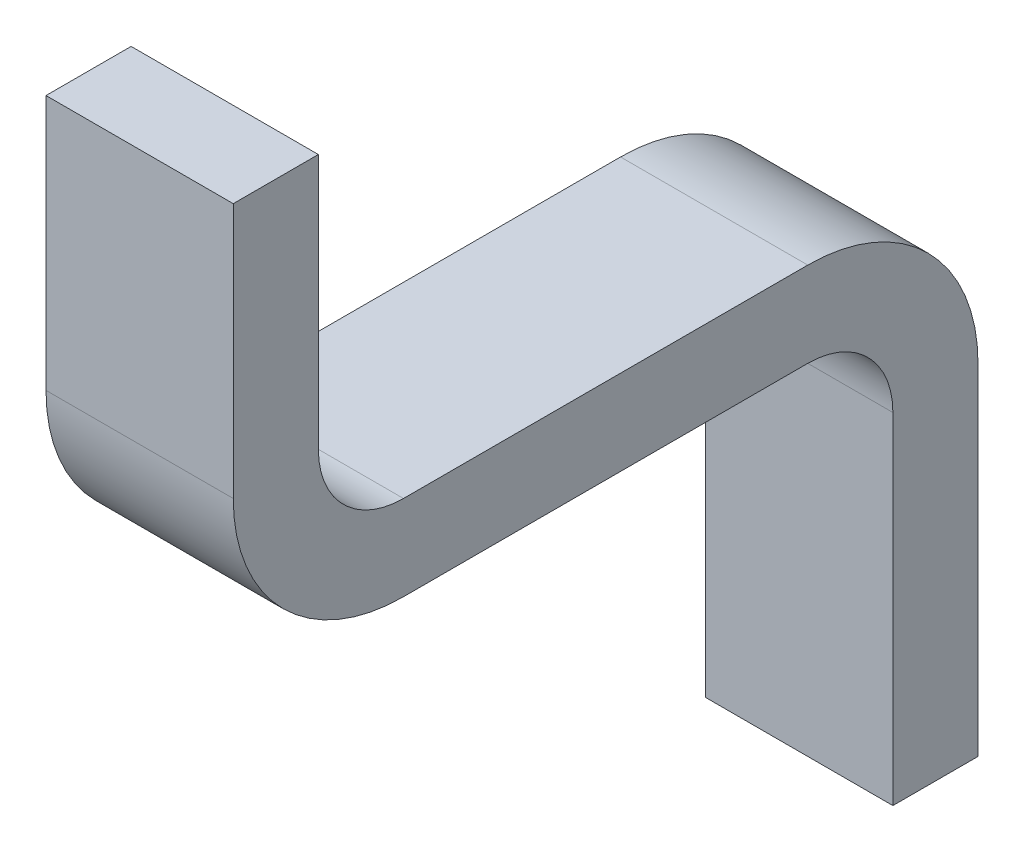
ISO-10303-21;
HEADER;
FILE_DESCRIPTION(('STEP AP214'),'2;1');
FILE_NAME('part.step','',(''),(''),'','','');
FILE_SCHEMA(('AUTOMOTIVE_DESIGN { 1 0 10303 214 1 1 1 1 }'));
ENDSEC;
DATA;
#1=APPLICATION_CONTEXT('core data for automotive mechanical design processes');
#2=APPLICATION_PROTOCOL_DEFINITION('international standard','automotive_design',2000,#1);
#3=PRODUCT_CONTEXT('',#1,'mechanical');
#4=PRODUCT('Part','Part','',(#3));
#5=PRODUCT_RELATED_PRODUCT_CATEGORY('part','',(#4));
#6=PRODUCT_DEFINITION_FORMATION('','',#4);
#7=PRODUCT_DEFINITION_CONTEXT('part definition',#1,'design');
#8=PRODUCT_DEFINITION('design','',#6,#7);
#9=PRODUCT_DEFINITION_SHAPE('','',#8);
#10=(LENGTH_UNIT() NAMED_UNIT(*) SI_UNIT(.MILLI.,.METRE.));
#11=(NAMED_UNIT(*) PLANE_ANGLE_UNIT() SI_UNIT($,.RADIAN.));
#12=(NAMED_UNIT(*) SI_UNIT($,.STERADIAN.) SOLID_ANGLE_UNIT());
#13=UNCERTAINTY_MEASURE_WITH_UNIT(LENGTH_MEASURE(1.E-05),#10,'distance_accuracy_value','');
#14=(GEOMETRIC_REPRESENTATION_CONTEXT(3) GLOBAL_UNCERTAINTY_ASSIGNED_CONTEXT((#13)) GLOBAL_UNIT_ASSIGNED_CONTEXT((#10,
#11,#12)) REPRESENTATION_CONTEXT('',''));
#15=CARTESIAN_POINT('',(0.,0.,0.));
#16=DIRECTION('',(0.,0.,1.));
#17=DIRECTION('',(1.,0.,0.));
#18=AXIS2_PLACEMENT_3D('',#15,#16,#17);
#19=CARTESIAN_POINT('',(1.14,-4.,0.675));
#20=DIRECTION('',(1.,0.,0.));
#21=DIRECTION('',(0.,1.,0.));
#22=AXIS2_PLACEMENT_3D('',#19,#20,#21);
#23=PLANE('',#22);
#24=CARTESIAN_POINT('',(1.14,-3.80000000000001,0.675));
#25=DIRECTION('',(-1.,0.,0.));
#26=DIRECTION('',(0.,-1.,0.));
#27=AXIS2_PLACEMENT_3D('',#24,#25,#26);
#28=CIRCLE('',#27,0.2);
#29=CARTESIAN_POINT('',(1.14,-3.80000000000001,0.875));
#30=VERTEX_POINT('',#29);
#31=CARTESIAN_POINT('',(1.14,-4.,0.675));
#32=VERTEX_POINT('',#31);
#33=EDGE_CURVE('E150',#30,#32,#28,.F.);
#34=ORIENTED_EDGE('',*,*,#33,.F.);
#35=DIRECTION('',(0.,1.,0.));
#36=VECTOR('',#35,1.);
#37=CARTESIAN_POINT('',(1.14,-3.5,0.875));
#38=LINE('',#37,#36);
#39=CARTESIAN_POINT('',(1.14,-3.5,0.875));
#40=VERTEX_POINT('',#39);
#41=EDGE_CURVE('E147',#30,#40,#38,.T.);
#42=ORIENTED_EDGE('',*,*,#41,.T.);
#43=DIRECTION('',(0.,0.,1.));
#44=VECTOR('',#43,1.);
#45=CARTESIAN_POINT('',(1.14,-3.5,0.775));
#46=LINE('',#45,#44);
#47=CARTESIAN_POINT('',(1.14,-3.5,0.775));
#48=VERTEX_POINT('',#47);
#49=EDGE_CURVE('E141',#48,#40,#46,.T.);
#50=ORIENTED_EDGE('',*,*,#49,.F.);
#51=DIRECTION('',(0.,1.,0.));
#52=VECTOR('',#51,1.);
#53=CARTESIAN_POINT('',(1.14,-3.5,0.775));
#54=LINE('',#53,#52);
#55=CARTESIAN_POINT('',(1.14,-3.80000000000001,0.775));
#56=VERTEX_POINT('',#55);
#57=EDGE_CURVE('E115',#48,#56,#54,.F.);
#58=ORIENTED_EDGE('',*,*,#57,.T.);
#59=CARTESIAN_POINT('',(1.14,-3.80000000000001,0.675));
#60=DIRECTION('',(-1.,0.,0.));
#61=DIRECTION('',(0.,-1.,0.));
#62=AXIS2_PLACEMENT_3D('',#59,#60,#61);
#63=CIRCLE('',#62,0.1);
#64=CARTESIAN_POINT('',(1.14,-3.9,0.675));
#65=VERTEX_POINT('',#64);
#66=EDGE_CURVE('E215',#56,#65,#63,.F.);
#67=ORIENTED_EDGE('',*,*,#66,.T.);
#68=DIRECTION('',(0.,0.,1.));
#69=VECTOR('',#68,1.);
#70=CARTESIAN_POINT('',(1.14,-3.9,0.675));
#71=LINE('',#70,#69);
#72=CARTESIAN_POINT('',(1.14,-3.9,0.2));
#73=VERTEX_POINT('',#72);
#74=EDGE_CURVE('E181',#65,#73,#71,.F.);
#75=ORIENTED_EDGE('',*,*,#74,.T.);
#76=CARTESIAN_POINT('',(1.14,-4.1,0.2));
#77=DIRECTION('',(1.,0.,0.));
#78=DIRECTION('',(0.,1.,0.));
#79=AXIS2_PLACEMENT_3D('',#76,#77,#78);
#80=CIRCLE('',#79,0.2);
#81=CARTESIAN_POINT('',(1.14,-4.1,0.));
#82=VERTEX_POINT('',#81);
#83=EDGE_CURVE('E20',#82,#73,#80,.T.);
#84=ORIENTED_EDGE('',*,*,#83,.F.);
#85=DIRECTION('',(0.,1.,0.));
#86=VECTOR('',#85,1.);
#87=CARTESIAN_POINT('',(1.14,-4.1,0.));
#88=LINE('',#87,#86);
#89=CARTESIAN_POINT('',(1.14,-4.5,0.));
#90=VERTEX_POINT('',#89);
#91=EDGE_CURVE('E91',#82,#90,#88,.F.);
#92=ORIENTED_EDGE('',*,*,#91,.T.);
#93=DIRECTION('',(0.,0.,1.));
#94=VECTOR('',#93,1.);
#95=CARTESIAN_POINT('',(1.14,-4.5,0.));
#96=LINE('',#95,#94);
#97=CARTESIAN_POINT('',(1.14,-4.5,0.1));
#98=VERTEX_POINT('',#97);
#99=EDGE_CURVE('E163',#90,#98,#96,.T.);
#100=ORIENTED_EDGE('',*,*,#99,.T.);
#101=DIRECTION('',(0.,1.,0.));
#102=VECTOR('',#101,1.);
#103=CARTESIAN_POINT('',(1.14,-4.1,0.1));
#104=LINE('',#103,#102);
#105=CARTESIAN_POINT('',(1.14,-4.1,0.1));
#106=VERTEX_POINT('',#105);
#107=EDGE_CURVE('E159',#98,#106,#104,.T.);
#108=ORIENTED_EDGE('',*,*,#107,.T.);
#109=CARTESIAN_POINT('',(1.14,-4.1,0.2));
#110=DIRECTION('',(1.,0.,0.));
#111=DIRECTION('',(0.,1.,0.));
#112=AXIS2_PLACEMENT_3D('',#109,#110,#111);
#113=CIRCLE('',#112,0.1);
#114=CARTESIAN_POINT('',(1.14,-4.,0.2));
#115=VERTEX_POINT('',#114);
#116=EDGE_CURVE('E155',#106,#115,#113,.T.);
#117=ORIENTED_EDGE('',*,*,#116,.T.);
#118=DIRECTION('',(0.,0.,1.));
#119=VECTOR('',#118,1.);
#120=CARTESIAN_POINT('',(1.14,-4.,0.675));
#121=LINE('',#120,#119);
#122=EDGE_CURVE('E154',#115,#32,#121,.T.);
#123=ORIENTED_EDGE('',*,*,#122,.T.);
#124=EDGE_LOOP('',(#34,#42,#50,#58,#67,#75,#84,#92,#100,#108,#117,#123));
#125=FACE_BOUND('',#124,.T.);
#126=ADVANCED_FACE('F17',(#125),#23,.F.);
#127=CARTESIAN_POINT('',(1.14,-4.1,0.2));
#128=DIRECTION('',(1.,0.,0.));
#129=DIRECTION('',(0.,1.,0.));
#130=AXIS2_PLACEMENT_3D('',#127,#128,#129);
#131=CYLINDRICAL_SURFACE('',#130,0.2);
#132=CARTESIAN_POINT('',(1.36,-4.1,0.2));
#133=DIRECTION('',(1.,0.,0.));
#134=DIRECTION('',(0.,1.,0.));
#135=AXIS2_PLACEMENT_3D('',#132,#133,#134);
#136=CIRCLE('',#135,0.2);
#137=CARTESIAN_POINT('',(1.36,-3.9,0.2));
#138=VERTEX_POINT('',#137);
#139=CARTESIAN_POINT('',(1.36,-4.1,0.));
#140=VERTEX_POINT('',#139);
#141=EDGE_CURVE('E183',#138,#140,#136,.F.);
#142=ORIENTED_EDGE('',*,*,#141,.T.);
#143=DIRECTION('',(1.,0.,0.));
#144=VECTOR('',#143,1.);
#145=CARTESIAN_POINT('',(1.14,-4.1,0.));
#146=LINE('',#145,#144);
#147=EDGE_CURVE('E178',#140,#82,#146,.F.);
#148=ORIENTED_EDGE('',*,*,#147,.T.);
#149=ORIENTED_EDGE('',*,*,#83,.T.);
#150=DIRECTION('',(1.,0.,0.));
#151=VECTOR('',#150,1.);
#152=CARTESIAN_POINT('',(1.14,-3.9,0.2));
#153=LINE('',#152,#151);
#154=EDGE_CURVE('E217',#73,#138,#153,.T.);
#155=ORIENTED_EDGE('',*,*,#154,.T.);
#156=EDGE_LOOP('',(#142,#148,#149,#155));
#157=FACE_BOUND('',#156,.T.);
#158=ADVANCED_FACE('F254',(#157),#131,.T.);
#159=CARTESIAN_POINT('',(1.14,-4.1,0.));
#160=DIRECTION('',(0.,0.,1.));
#161=DIRECTION('',(1.,0.,0.));
#162=AXIS2_PLACEMENT_3D('',#159,#160,#161);
#163=PLANE('',#162);
#164=ORIENTED_EDGE('',*,*,#147,.F.);
#165=DIRECTION('',(0.,-1.,0.));
#166=VECTOR('',#165,1.);
#167=CARTESIAN_POINT('',(1.36,-3.9,0.));
#168=LINE('',#167,#166);
#169=CARTESIAN_POINT('',(1.36,-4.5,0.));
#170=VERTEX_POINT('',#169);
#171=EDGE_CURVE('E170',#140,#170,#168,.T.);
#172=ORIENTED_EDGE('',*,*,#171,.T.);
#173=DIRECTION('',(-1.,0.,0.));
#174=VECTOR('',#173,1.);
#175=CARTESIAN_POINT('',(1.14,-4.5,0.));
#176=LINE('',#175,#174);
#177=EDGE_CURVE('E173',#170,#90,#176,.T.);
#178=ORIENTED_EDGE('',*,*,#177,.T.);
#179=ORIENTED_EDGE('',*,*,#91,.F.);
#180=EDGE_LOOP('',(#164,#172,#178,#179));
#181=FACE_BOUND('',#180,.T.);
#182=ADVANCED_FACE('F257',(#181),#163,.F.);
#183=CARTESIAN_POINT('',(1.14,-4.5,0.));
#184=DIRECTION('',(0.,1.,0.));
#185=DIRECTION('',(-1.,0.,0.));
#186=AXIS2_PLACEMENT_3D('',#183,#184,#185);
#187=PLANE('',#186);
#188=DIRECTION('',(-1.,0.,0.));
#189=VECTOR('',#188,1.);
#190=CARTESIAN_POINT('',(1.36,-4.5,0.1));
#191=LINE('',#190,#189);
#192=CARTESIAN_POINT('',(1.36,-4.5,0.1));
#193=VERTEX_POINT('',#192);
#194=EDGE_CURVE('E160',#193,#98,#191,.T.);
#195=ORIENTED_EDGE('',*,*,#194,.T.);
#196=ORIENTED_EDGE('',*,*,#99,.F.);
#197=ORIENTED_EDGE('',*,*,#177,.F.);
#198=DIRECTION('',(0.,0.,1.));
#199=VECTOR('',#198,1.);
#200=CARTESIAN_POINT('',(1.36,-4.5,0.675));
#201=LINE('',#200,#199);
#202=EDGE_CURVE('E166',#170,#193,#201,.T.);
#203=ORIENTED_EDGE('',*,*,#202,.T.);
#204=EDGE_LOOP('',(#195,#196,#197,#203));
#205=FACE_BOUND('',#204,.T.);
#206=ADVANCED_FACE('F259',(#205),#187,.F.);
#207=CARTESIAN_POINT('',(1.36,-4.1,0.1));
#208=DIRECTION('',(0.,0.,-1.));
#209=DIRECTION('',(-1.,0.,0.));
#210=AXIS2_PLACEMENT_3D('',#207,#208,#209);
#211=PLANE('',#210);
#212=DIRECTION('',(1.,0.,0.));
#213=VECTOR('',#212,1.);
#214=CARTESIAN_POINT('',(1.36,-4.1,0.1));
#215=LINE('',#214,#213);
#216=CARTESIAN_POINT('',(1.36,-4.1,0.1));
#217=VERTEX_POINT('',#216);
#218=EDGE_CURVE('E156',#217,#106,#215,.F.);
#219=ORIENTED_EDGE('',*,*,#218,.T.);
#220=ORIENTED_EDGE('',*,*,#107,.F.);
#221=ORIENTED_EDGE('',*,*,#194,.F.);
#222=DIRECTION('',(0.,-1.,0.));
#223=VECTOR('',#222,1.);
#224=CARTESIAN_POINT('',(1.36,-3.9,0.1));
#225=LINE('',#224,#223);
#226=EDGE_CURVE('E169',#193,#217,#225,.F.);
#227=ORIENTED_EDGE('',*,*,#226,.T.);
#228=EDGE_LOOP('',(#219,#220,#221,#227));
#229=FACE_BOUND('',#228,.T.);
#230=ADVANCED_FACE('F234',(#229),#211,.F.);
#231=CARTESIAN_POINT('',(1.36,-4.1,0.2));
#232=DIRECTION('',(1.,0.,0.));
#233=DIRECTION('',(0.,1.,0.));
#234=AXIS2_PLACEMENT_3D('',#231,#232,#233);
#235=CYLINDRICAL_SURFACE('',#234,0.1);
#236=DIRECTION('',(-1.,0.,0.));
#237=VECTOR('',#236,1.);
#238=CARTESIAN_POINT('',(1.36,-4.,0.2));
#239=LINE('',#238,#237);
#240=CARTESIAN_POINT('',(1.36,-4.,0.2));
#241=VERTEX_POINT('',#240);
#242=EDGE_CURVE('E151',#241,#115,#239,.T.);
#243=ORIENTED_EDGE('',*,*,#242,.T.);
#244=ORIENTED_EDGE('',*,*,#116,.F.);
#245=ORIENTED_EDGE('',*,*,#218,.F.);
#246=CARTESIAN_POINT('',(1.36,-4.1,0.2));
#247=DIRECTION('',(1.,0.,0.));
#248=DIRECTION('',(0.,1.,0.));
#249=AXIS2_PLACEMENT_3D('',#246,#247,#248);
#250=CIRCLE('',#249,0.1);
#251=EDGE_CURVE('E210',#217,#241,#250,.T.);
#252=ORIENTED_EDGE('',*,*,#251,.T.);
#253=EDGE_LOOP('',(#243,#244,#245,#252));
#254=FACE_BOUND('',#253,.T.);
#255=ADVANCED_FACE('F227',(#254),#235,.F.);
#256=CARTESIAN_POINT('',(1.36,-4.,0.675));
#257=DIRECTION('',(0.,1.,0.));
#258=DIRECTION('',(-1.,0.,0.));
#259=AXIS2_PLACEMENT_3D('',#256,#257,#258);
#260=PLANE('',#259);
#261=DIRECTION('',(-1.,0.,0.));
#262=VECTOR('',#261,1.);
#263=CARTESIAN_POINT('',(1.36,-4.,0.675));
#264=LINE('',#263,#262);
#265=CARTESIAN_POINT('',(1.36,-4.,0.675));
#266=VERTEX_POINT('',#265);
#267=EDGE_CURVE('E148',#32,#266,#264,.F.);
#268=ORIENTED_EDGE('',*,*,#267,.F.);
#269=ORIENTED_EDGE('',*,*,#122,.F.);
#270=ORIENTED_EDGE('',*,*,#242,.F.);
#271=DIRECTION('',(0.,0.,1.));
#272=VECTOR('',#271,1.);
#273=CARTESIAN_POINT('',(1.36,-4.,0.675));
#274=LINE('',#273,#272);
#275=EDGE_CURVE('E209',#241,#266,#274,.T.);
#276=ORIENTED_EDGE('',*,*,#275,.T.);
#277=EDGE_LOOP('',(#268,#269,#270,#276));
#278=FACE_BOUND('',#277,.T.);
#279=ADVANCED_FACE('F224',(#278),#260,.F.);
#280=CARTESIAN_POINT('',(1.36,-3.8,0.675));
#281=DIRECTION('',(-1.,0.,0.));
#282=DIRECTION('',(0.,-1.,0.));
#283=AXIS2_PLACEMENT_3D('',#280,#281,#282);
#284=CYLINDRICAL_SURFACE('',#283,0.2);
#285=ORIENTED_EDGE('',*,*,#33,.T.);
#286=ORIENTED_EDGE('',*,*,#267,.T.);
#287=CARTESIAN_POINT('',(1.36,-3.8,0.675));
#288=DIRECTION('',(-1.,0.,0.));
#289=DIRECTION('',(0.,-1.,0.));
#290=AXIS2_PLACEMENT_3D('',#287,#288,#289);
#291=CIRCLE('',#290,0.2);
#292=CARTESIAN_POINT('',(1.36,-3.8,0.875));
#293=VERTEX_POINT('',#292);
#294=EDGE_CURVE('E133',#266,#293,#291,.T.);
#295=ORIENTED_EDGE('',*,*,#294,.T.);
#296=DIRECTION('',(-1.,0.,0.));
#297=VECTOR('',#296,1.);
#298=CARTESIAN_POINT('',(1.36,-3.8,0.875));
#299=LINE('',#298,#297);
#300=EDGE_CURVE('E144',#293,#30,#299,.T.);
#301=ORIENTED_EDGE('',*,*,#300,.T.);
#302=EDGE_LOOP('',(#285,#286,#295,#301));
#303=FACE_BOUND('',#302,.T.);
#304=ADVANCED_FACE('F285',(#303),#284,.T.);
#305=CARTESIAN_POINT('',(1.36,-3.5,0.875));
#306=DIRECTION('',(0.,0.,-1.));
#307=DIRECTION('',(-1.,0.,0.));
#308=AXIS2_PLACEMENT_3D('',#305,#306,#307);
#309=PLANE('',#308);
#310=DIRECTION('',(-1.,0.,0.));
#311=VECTOR('',#310,1.);
#312=CARTESIAN_POINT('',(1.14,-3.5,0.875));
#313=LINE('',#312,#311);
#314=CARTESIAN_POINT('',(1.36,-3.5,0.875));
#315=VERTEX_POINT('',#314);
#316=EDGE_CURVE('E118',#40,#315,#313,.F.);
#317=ORIENTED_EDGE('',*,*,#316,.F.);
#318=ORIENTED_EDGE('',*,*,#41,.F.);
#319=ORIENTED_EDGE('',*,*,#300,.F.);
#320=DIRECTION('',(0.,-1.,0.));
#321=VECTOR('',#320,1.);
#322=CARTESIAN_POINT('',(1.36,-3.9,0.875));
#323=LINE('',#322,#321);
#324=EDGE_CURVE('E131',#293,#315,#323,.F.);
#325=ORIENTED_EDGE('',*,*,#324,.T.);
#326=EDGE_LOOP('',(#317,#318,#319,#325));
#327=FACE_BOUND('',#326,.T.);
#328=ADVANCED_FACE('F282',(#327),#309,.F.);
#329=CARTESIAN_POINT('',(1.14,-3.5,0.775));
#330=DIRECTION('',(0.,1.,0.));
#331=DIRECTION('',(-1.,0.,0.));
#332=AXIS2_PLACEMENT_3D('',#329,#330,#331);
#333=PLANE('',#332);
#334=ORIENTED_EDGE('',*,*,#49,.T.);
#335=ORIENTED_EDGE('',*,*,#316,.T.);
#336=DIRECTION('',(0.,0.,1.));
#337=VECTOR('',#336,1.);
#338=CARTESIAN_POINT('',(1.36,-3.5,0.675));
#339=LINE('',#338,#337);
#340=CARTESIAN_POINT('',(1.36,-3.5,0.775));
#341=VERTEX_POINT('',#340);
#342=EDGE_CURVE('E125',#315,#341,#339,.F.);
#343=ORIENTED_EDGE('',*,*,#342,.T.);
#344=DIRECTION('',(1.,0.,0.));
#345=VECTOR('',#344,1.);
#346=CARTESIAN_POINT('',(1.14,-3.5,0.775));
#347=LINE('',#346,#345);
#348=EDGE_CURVE('E110',#341,#48,#347,.F.);
#349=ORIENTED_EDGE('',*,*,#348,.T.);
#350=EDGE_LOOP('',(#334,#335,#343,#349));
#351=FACE_BOUND('',#350,.T.);
#352=ADVANCED_FACE('F129',(#351),#333,.T.);
#353=CARTESIAN_POINT('',(1.14,-3.5,0.775));
#354=DIRECTION('',(0.,0.,1.));
#355=DIRECTION('',(1.,0.,0.));
#356=AXIS2_PLACEMENT_3D('',#353,#354,#355);
#357=PLANE('',#356);
#358=ORIENTED_EDGE('',*,*,#348,.F.);
#359=DIRECTION('',(0.,-1.,0.));
#360=VECTOR('',#359,1.);
#361=CARTESIAN_POINT('',(1.36,-3.9,0.775));
#362=LINE('',#361,#360);
#363=CARTESIAN_POINT('',(1.36,-3.8,0.775));
#364=VERTEX_POINT('',#363);
#365=EDGE_CURVE('E114',#341,#364,#362,.T.);
#366=ORIENTED_EDGE('',*,*,#365,.T.);
#367=DIRECTION('',(-1.,0.,0.));
#368=VECTOR('',#367,1.);
#369=CARTESIAN_POINT('',(1.14,-3.80000000000001,0.775));
#370=LINE('',#369,#368);
#371=EDGE_CURVE('E185',#364,#56,#370,.T.);
#372=ORIENTED_EDGE('',*,*,#371,.T.);
#373=ORIENTED_EDGE('',*,*,#57,.F.);
#374=EDGE_LOOP('',(#358,#366,#372,#373));
#375=FACE_BOUND('',#374,.T.);
#376=ADVANCED_FACE('F112',(#375),#357,.F.);
#377=CARTESIAN_POINT('',(1.14,-3.80000000000001,0.675));
#378=DIRECTION('',(-1.,0.,0.));
#379=DIRECTION('',(0.,-1.,0.));
#380=AXIS2_PLACEMENT_3D('',#377,#378,#379);
#381=CYLINDRICAL_SURFACE('',#380,0.1);
#382=ORIENTED_EDGE('',*,*,#371,.F.);
#383=CARTESIAN_POINT('',(1.36,-3.8,0.675));
#384=DIRECTION('',(-1.,0.,0.));
#385=DIRECTION('',(0.,-1.,0.));
#386=AXIS2_PLACEMENT_3D('',#383,#384,#385);
#387=CIRCLE('',#386,0.1);
#388=CARTESIAN_POINT('',(1.36,-3.9,0.675));
#389=VERTEX_POINT('',#388);
#390=EDGE_CURVE('E26',#364,#389,#387,.F.);
#391=ORIENTED_EDGE('',*,*,#390,.T.);
#392=DIRECTION('',(1.,0.,0.));
#393=VECTOR('',#392,1.);
#394=CARTESIAN_POINT('',(1.14,-3.9,0.675));
#395=LINE('',#394,#393);
#396=EDGE_CURVE('E34',#389,#65,#395,.F.);
#397=ORIENTED_EDGE('',*,*,#396,.T.);
#398=ORIENTED_EDGE('',*,*,#66,.F.);
#399=EDGE_LOOP('',(#382,#391,#397,#398));
#400=FACE_BOUND('',#399,.T.);
#401=ADVANCED_FACE('F250',(#400),#381,.F.);
#402=CARTESIAN_POINT('',(1.14,-3.9,0.675));
#403=DIRECTION('',(0.,-1.,0.));
#404=DIRECTION('',(1.,0.,0.));
#405=AXIS2_PLACEMENT_3D('',#402,#403,#404);
#406=PLANE('',#405);
#407=ORIENTED_EDGE('',*,*,#396,.F.);
#408=DIRECTION('',(0.,0.,1.));
#409=VECTOR('',#408,1.);
#410=CARTESIAN_POINT('',(1.36,-3.9,0.675));
#411=LINE('',#410,#409);
#412=EDGE_CURVE('E11',#389,#138,#411,.F.);
#413=ORIENTED_EDGE('',*,*,#412,.T.);
#414=ORIENTED_EDGE('',*,*,#154,.F.);
#415=ORIENTED_EDGE('',*,*,#74,.F.);
#416=EDGE_LOOP('',(#407,#413,#414,#415));
#417=FACE_BOUND('',#416,.T.);
#418=ADVANCED_FACE('F252',(#417),#406,.F.);
#419=CARTESIAN_POINT('',(1.36,-3.9,0.675));
#420=DIRECTION('',(-1.,0.,0.));
#421=DIRECTION('',(0.,-1.,0.));
#422=AXIS2_PLACEMENT_3D('',#419,#420,#421);
#423=PLANE('',#422);
#424=ORIENTED_EDGE('',*,*,#390,.F.);
#425=ORIENTED_EDGE('',*,*,#365,.F.);
#426=ORIENTED_EDGE('',*,*,#342,.F.);
#427=ORIENTED_EDGE('',*,*,#324,.F.);
#428=ORIENTED_EDGE('',*,*,#294,.F.);
#429=ORIENTED_EDGE('',*,*,#275,.F.);
#430=ORIENTED_EDGE('',*,*,#251,.F.);
#431=ORIENTED_EDGE('',*,*,#226,.F.);
#432=ORIENTED_EDGE('',*,*,#202,.F.);
#433=ORIENTED_EDGE('',*,*,#171,.F.);
#434=ORIENTED_EDGE('',*,*,#141,.F.);
#435=ORIENTED_EDGE('',*,*,#412,.F.);
#436=EDGE_LOOP('',(#424,#425,#426,#427,#428,#429,#430,#431,#432,#433,#434,#435));
#437=FACE_BOUND('',#436,.T.);
#438=ADVANCED_FACE('F123',(#437),#423,.F.);
#439=CLOSED_SHELL('',(#126,#158,#182,#206,#230,#255,#279,#304,#328,#352,#376,#401,#418,#438));
#440=MANIFOLD_SOLID_BREP('B1',#439);
#441=ADVANCED_BREP_SHAPE_REPRESENTATION('',(#18,#440),#14);
#442=SHAPE_DEFINITION_REPRESENTATION(#9,#441);
ENDSEC;
END-ISO-10303-21;
